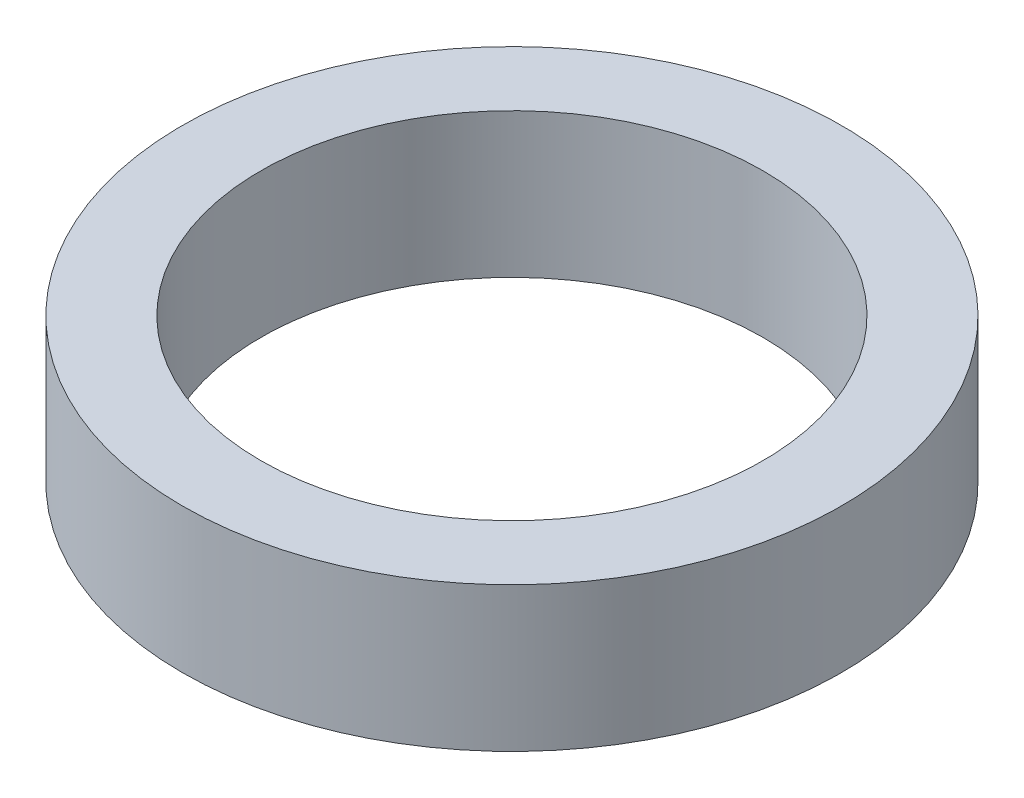
ISO-10303-21;
HEADER;
FILE_DESCRIPTION(('STEP AP214'),'2;1');
FILE_NAME('part.step','',(''),(''),'','','');
FILE_SCHEMA(('AUTOMOTIVE_DESIGN { 1 0 10303 214 1 1 1 1 }'));
ENDSEC;
DATA;
#1=APPLICATION_CONTEXT('core data for automotive mechanical design processes');
#2=APPLICATION_PROTOCOL_DEFINITION('international standard','automotive_design',2000,#1);
#3=PRODUCT_CONTEXT('',#1,'mechanical');
#4=PRODUCT('Part','Part','',(#3));
#5=PRODUCT_RELATED_PRODUCT_CATEGORY('part','',(#4));
#6=PRODUCT_DEFINITION_FORMATION('','',#4);
#7=PRODUCT_DEFINITION_CONTEXT('part definition',#1,'design');
#8=PRODUCT_DEFINITION('design','',#6,#7);
#9=PRODUCT_DEFINITION_SHAPE('','',#8);
#10=(LENGTH_UNIT() NAMED_UNIT(*) SI_UNIT(.MILLI.,.METRE.));
#11=(NAMED_UNIT(*) PLANE_ANGLE_UNIT() SI_UNIT($,.RADIAN.));
#12=(NAMED_UNIT(*) SI_UNIT($,.STERADIAN.) SOLID_ANGLE_UNIT());
#13=UNCERTAINTY_MEASURE_WITH_UNIT(LENGTH_MEASURE(1.E-05),#10,'distance_accuracy_value','');
#14=(GEOMETRIC_REPRESENTATION_CONTEXT(3) GLOBAL_UNCERTAINTY_ASSIGNED_CONTEXT((#13)) GLOBAL_UNIT_ASSIGNED_CONTEXT((#10,
#11,#12)) REPRESENTATION_CONTEXT('',''));
#15=CARTESIAN_POINT('',(0.,0.,0.));
#16=DIRECTION('',(0.,0.,1.));
#17=DIRECTION('',(1.,0.,0.));
#18=AXIS2_PLACEMENT_3D('',#15,#16,#17);
#19=CARTESIAN_POINT('',(0.,23.,0.));
#20=DIRECTION('',(0.,-1.,0.));
#21=DIRECTION('',(0.,0.,-1.));
#22=AXIS2_PLACEMENT_3D('',#19,#20,#21);
#23=CYLINDRICAL_SURFACE('',#22,52.5);
#24=CARTESIAN_POINT('',(0.,23.,0.));
#25=DIRECTION('',(0.,1.,0.));
#26=DIRECTION('',(0.,0.,1.));
#27=AXIS2_PLACEMENT_3D('',#24,#25,#26);
#28=CIRCLE('',#27,52.5);
#29=CARTESIAN_POINT('',(0.,23.,52.5));
#30=VERTEX_POINT('',#29);
#31=EDGE_CURVE('E10',#30,#30,#28,.T.);
#32=ORIENTED_EDGE('',*,*,#31,.F.);
#33=EDGE_LOOP('',(#32));
#34=FACE_BOUND('',#33,.T.);
#35=CARTESIAN_POINT('',(0.,0.,0.));
#36=DIRECTION('',(0.,1.,0.));
#37=DIRECTION('',(0.,0.,1.));
#38=AXIS2_PLACEMENT_3D('',#35,#36,#37);
#39=CIRCLE('',#38,52.5);
#40=CARTESIAN_POINT('',(0.,0.,52.5));
#41=VERTEX_POINT('',#40);
#42=EDGE_CURVE('E37',#41,#41,#39,.T.);
#43=ORIENTED_EDGE('',*,*,#42,.T.);
#44=EDGE_LOOP('',(#43));
#45=FACE_BOUND('',#44,.T.);
#46=ADVANCED_FACE('F40',(#34,#45),#23,.T.);
#47=CARTESIAN_POINT('',(0.,23.,0.));
#48=DIRECTION('',(0.,1.,0.));
#49=DIRECTION('',(0.,0.,1.));
#50=AXIS2_PLACEMENT_3D('',#47,#48,#49);
#51=PLANE('',#50);
#52=CARTESIAN_POINT('',(0.,23.,0.));
#53=DIRECTION('',(0.,1.,0.));
#54=DIRECTION('',(0.,0.,1.));
#55=AXIS2_PLACEMENT_3D('',#52,#53,#54);
#56=CIRCLE('',#55,40.);
#57=CARTESIAN_POINT('',(0.,23.,40.));
#58=VERTEX_POINT('',#57);
#59=EDGE_CURVE('E50',#58,#58,#56,.T.);
#60=ORIENTED_EDGE('',*,*,#59,.F.);
#61=EDGE_LOOP('',(#60));
#62=FACE_BOUND('',#61,.T.);
#63=ORIENTED_EDGE('',*,*,#31,.T.);
#64=EDGE_LOOP('',(#63));
#65=FACE_BOUND('',#64,.T.);
#66=ADVANCED_FACE('F59',(#62,#65),#51,.T.);
#67=CARTESIAN_POINT('',(0.,0.,0.));
#68=DIRECTION('',(0.,1.,0.));
#69=DIRECTION('',(0.,0.,1.));
#70=AXIS2_PLACEMENT_3D('',#67,#68,#69);
#71=PLANE('',#70);
#72=CARTESIAN_POINT('',(0.,0.,0.));
#73=DIRECTION('',(0.,1.,0.));
#74=DIRECTION('',(0.,0.,1.));
#75=AXIS2_PLACEMENT_3D('',#72,#73,#74);
#76=CIRCLE('',#75,40.);
#77=CARTESIAN_POINT('',(0.,0.,40.));
#78=VERTEX_POINT('',#77);
#79=EDGE_CURVE('E47',#78,#78,#76,.T.);
#80=ORIENTED_EDGE('',*,*,#79,.T.);
#81=EDGE_LOOP('',(#80));
#82=FACE_BOUND('',#81,.T.);
#83=ORIENTED_EDGE('',*,*,#42,.F.);
#84=EDGE_LOOP('',(#83));
#85=FACE_BOUND('',#84,.T.);
#86=ADVANCED_FACE('F58',(#82,#85),#71,.F.);
#87=CARTESIAN_POINT('',(0.,23.,0.));
#88=DIRECTION('',(0.,-1.,0.));
#89=DIRECTION('',(0.,0.,-1.));
#90=AXIS2_PLACEMENT_3D('',#87,#88,#89);
#91=CYLINDRICAL_SURFACE('',#90,40.);
#92=ORIENTED_EDGE('',*,*,#59,.T.);
#93=EDGE_LOOP('',(#92));
#94=FACE_BOUND('',#93,.T.);
#95=ORIENTED_EDGE('',*,*,#79,.F.);
#96=EDGE_LOOP('',(#95));
#97=FACE_BOUND('',#96,.T.);
#98=ADVANCED_FACE('F54',(#94,#97),#91,.F.);
#99=CLOSED_SHELL('',(#46,#66,#86,#98));
#100=MANIFOLD_SOLID_BREP('B2',#99);
#101=ADVANCED_BREP_SHAPE_REPRESENTATION('',(#18,#100),#14);
#102=SHAPE_DEFINITION_REPRESENTATION(#9,#101);
ENDSEC;
END-ISO-10303-21;
